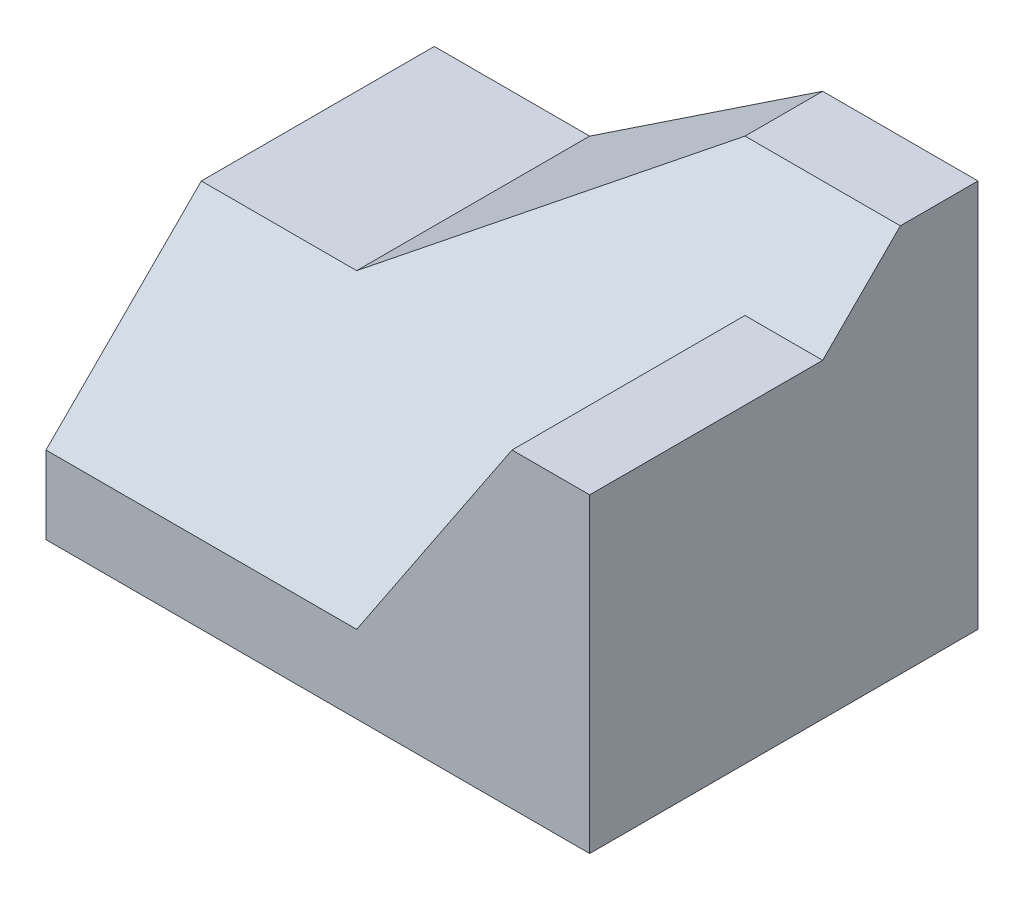
ISO-10303-21;
HEADER;
FILE_DESCRIPTION(('STEP AP214'),'2;1');
FILE_NAME('part.step','',(''),(''),'','','');
FILE_SCHEMA(('AUTOMOTIVE_DESIGN { 1 0 10303 214 1 1 1 1 }'));
ENDSEC;
DATA;
#1=APPLICATION_CONTEXT('core data for automotive mechanical design processes');
#2=APPLICATION_PROTOCOL_DEFINITION('international standard','automotive_design',2000,#1);
#3=PRODUCT_CONTEXT('',#1,'mechanical');
#4=PRODUCT('Part','Part','',(#3));
#5=PRODUCT_RELATED_PRODUCT_CATEGORY('part','',(#4));
#6=PRODUCT_DEFINITION_FORMATION('','',#4);
#7=PRODUCT_DEFINITION_CONTEXT('part definition',#1,'design');
#8=PRODUCT_DEFINITION('design','',#6,#7);
#9=PRODUCT_DEFINITION_SHAPE('','',#8);
#10=(LENGTH_UNIT() NAMED_UNIT(*) SI_UNIT(.MILLI.,.METRE.));
#11=(NAMED_UNIT(*) PLANE_ANGLE_UNIT() SI_UNIT($,.RADIAN.));
#12=(NAMED_UNIT(*) SI_UNIT($,.STERADIAN.) SOLID_ANGLE_UNIT());
#13=UNCERTAINTY_MEASURE_WITH_UNIT(LENGTH_MEASURE(1.E-05),#10,'distance_accuracy_value','');
#14=(GEOMETRIC_REPRESENTATION_CONTEXT(3) GLOBAL_UNCERTAINTY_ASSIGNED_CONTEXT((#13)) GLOBAL_UNIT_ASSIGNED_CONTEXT((#10,
#11,#12)) REPRESENTATION_CONTEXT('',''));
#15=CARTESIAN_POINT('',(0.,0.,0.));
#16=DIRECTION('',(0.,0.,1.));
#17=DIRECTION('',(1.,0.,0.));
#18=AXIS2_PLACEMENT_3D('',#15,#16,#17);
#19=CARTESIAN_POINT('',(0.,0.,50.));
#20=DIRECTION('',(1.,0.,0.));
#21=DIRECTION('',(0.,0.,-1.));
#22=AXIS2_PLACEMENT_3D('',#19,#20,#21);
#23=PLANE('',#22);
#24=DIRECTION('',(0.,-1.,0.));
#25=VECTOR('',#24,1.);
#26=CARTESIAN_POINT('',(0.,0.,0.));
#27=LINE('',#26,#25);
#28=CARTESIAN_POINT('',(0.,30.,0.));
#29=VERTEX_POINT('',#28);
#30=CARTESIAN_POINT('',(0.,0.,0.));
#31=VERTEX_POINT('',#30);
#32=EDGE_CURVE('E149',#29,#31,#27,.T.);
#33=ORIENTED_EDGE('',*,*,#32,.T.);
#34=DIRECTION('',(0.,0.,-1.));
#35=VECTOR('',#34,1.);
#36=CARTESIAN_POINT('',(0.,0.,50.));
#37=LINE('',#36,#35);
#38=CARTESIAN_POINT('',(0.,0.,50.));
#39=VERTEX_POINT('',#38);
#40=EDGE_CURVE('E11',#39,#31,#37,.T.);
#41=ORIENTED_EDGE('',*,*,#40,.F.);
#42=DIRECTION('',(0.,-1.,0.));
#43=VECTOR('',#42,1.);
#44=CARTESIAN_POINT('',(0.,0.,50.));
#45=LINE('',#44,#43);
#46=CARTESIAN_POINT('',(0.,10.,50.));
#47=VERTEX_POINT('',#46);
#48=EDGE_CURVE('E152',#47,#39,#45,.T.);
#49=ORIENTED_EDGE('',*,*,#48,.F.);
#50=DIRECTION('',(0.,0.707106781186548,-0.707106781186548));
#51=VECTOR('',#50,1.);
#52=CARTESIAN_POINT('',(0.,10.,50.));
#53=LINE('',#52,#51);
#54=CARTESIAN_POINT('',(0.,30.,30.));
#55=VERTEX_POINT('',#54);
#56=EDGE_CURVE('E117',#47,#55,#53,.T.);
#57=ORIENTED_EDGE('',*,*,#56,.T.);
#58=DIRECTION('',(0.,0.,1.));
#59=VECTOR('',#58,1.);
#60=CARTESIAN_POINT('',(0.,30.,0.));
#61=LINE('',#60,#59);
#62=EDGE_CURVE('E110',#29,#55,#61,.T.);
#63=ORIENTED_EDGE('',*,*,#62,.F.);
#64=EDGE_LOOP('',(#33,#41,#49,#57,#63));
#65=FACE_BOUND('',#64,.T.);
#66=ADVANCED_FACE('F35',(#65),#23,.F.);
#67=CARTESIAN_POINT('',(20.,30.,0.));
#68=DIRECTION('',(0.554700196225231,-0.832050294337842,0.));
#69=DIRECTION('',(0.832050294337842,0.554700196225231,0.));
#70=AXIS2_PLACEMENT_3D('',#67,#68,#69);
#71=PLANE('',#70);
#72=DIRECTION('',(0.,0.,1.));
#73=VECTOR('',#72,1.);
#74=CARTESIAN_POINT('',(20.,30.,0.));
#75=LINE('',#74,#73);
#76=CARTESIAN_POINT('',(20.,30.,0.));
#77=VERTEX_POINT('',#76);
#78=CARTESIAN_POINT('',(20.,30.,30.));
#79=VERTEX_POINT('',#78);
#80=EDGE_CURVE('E101',#77,#79,#75,.T.);
#81=ORIENTED_EDGE('',*,*,#80,.T.);
#82=DIRECTION('',(-0.727606875108997,-0.485071250072668,0.485071250072668));
#83=VECTOR('',#82,1.);
#84=CARTESIAN_POINT('',(27.0588235294118,34.7058823529412,25.2941176470588));
#85=LINE('',#84,#83);
#86=CARTESIAN_POINT('',(49.9999999999998,50.,10.));
#87=VERTEX_POINT('',#86);
#88=EDGE_CURVE('E105',#87,#79,#85,.T.);
#89=ORIENTED_EDGE('',*,*,#88,.F.);
#90=DIRECTION('',(0.,0.,1.));
#91=VECTOR('',#90,1.);
#92=CARTESIAN_POINT('',(49.9999999999998,50.,0.));
#93=LINE('',#92,#91);
#94=CARTESIAN_POINT('',(49.9999999999998,50.,0.));
#95=VERTEX_POINT('',#94);
#96=EDGE_CURVE('E109',#95,#87,#93,.T.);
#97=ORIENTED_EDGE('',*,*,#96,.F.);
#98=DIRECTION('',(0.832050294337842,0.554700196225231,0.));
#99=VECTOR('',#98,1.);
#100=CARTESIAN_POINT('',(20.,30.,0.));
#101=LINE('',#100,#99);
#102=EDGE_CURVE('E57',#77,#95,#101,.T.);
#103=ORIENTED_EDGE('',*,*,#102,.F.);
#104=EDGE_LOOP('',(#81,#89,#97,#103));
#105=FACE_BOUND('',#104,.T.);
#106=ADVANCED_FACE('F103',(#105),#71,.F.);
#107=CARTESIAN_POINT('',(0.,30.,0.));
#108=DIRECTION('',(0.,-1.,0.));
#109=DIRECTION('',(0.,0.,-1.));
#110=AXIS2_PLACEMENT_3D('',#107,#108,#109);
#111=PLANE('',#110);
#112=ORIENTED_EDGE('',*,*,#62,.T.);
#113=DIRECTION('',(-1.,0.,0.));
#114=VECTOR('',#113,1.);
#115=CARTESIAN_POINT('',(20.,30.,30.));
#116=LINE('',#115,#114);
#117=EDGE_CURVE('E113',#79,#55,#116,.T.);
#118=ORIENTED_EDGE('',*,*,#117,.F.);
#119=ORIENTED_EDGE('',*,*,#80,.F.);
#120=DIRECTION('',(1.,0.,0.));
#121=VECTOR('',#120,1.);
#122=CARTESIAN_POINT('',(0.,30.,0.));
#123=LINE('',#122,#121);
#124=EDGE_CURVE('E143',#29,#77,#123,.T.);
#125=ORIENTED_EDGE('',*,*,#124,.F.);
#126=EDGE_LOOP('',(#112,#118,#119,#125));
#127=FACE_BOUND('',#126,.T.);
#128=ADVANCED_FACE('F114',(#127),#111,.F.);
#129=CARTESIAN_POINT('',(0.,0.,50.));
#130=DIRECTION('',(0.,1.,0.));
#131=DIRECTION('',(0.,0.,1.));
#132=AXIS2_PLACEMENT_3D('',#129,#130,#131);
#133=PLANE('',#132);
#134=ORIENTED_EDGE('',*,*,#40,.T.);
#135=DIRECTION('',(1.,0.,0.));
#136=VECTOR('',#135,1.);
#137=CARTESIAN_POINT('',(0.,0.,0.));
#138=LINE('',#137,#136);
#139=CARTESIAN_POINT('',(70.,0.,0.));
#140=VERTEX_POINT('',#139);
#141=EDGE_CURVE('E163',#31,#140,#138,.T.);
#142=ORIENTED_EDGE('',*,*,#141,.T.);
#143=DIRECTION('',(0.,0.,-1.));
#144=VECTOR('',#143,1.);
#145=CARTESIAN_POINT('',(70.,0.,50.));
#146=LINE('',#145,#144);
#147=CARTESIAN_POINT('',(70.,0.,50.));
#148=VERTEX_POINT('',#147);
#149=EDGE_CURVE('E42',#148,#140,#146,.T.);
#150=ORIENTED_EDGE('',*,*,#149,.F.);
#151=DIRECTION('',(1.,0.,0.));
#152=VECTOR('',#151,1.);
#153=CARTESIAN_POINT('',(0.,0.,50.));
#154=LINE('',#153,#152);
#155=EDGE_CURVE('E154',#39,#148,#154,.T.);
#156=ORIENTED_EDGE('',*,*,#155,.F.);
#157=EDGE_LOOP('',(#134,#142,#150,#156));
#158=FACE_BOUND('',#157,.T.);
#159=ADVANCED_FACE('F196',(#158),#133,.F.);
#160=CARTESIAN_POINT('',(0.,0.,0.));
#161=DIRECTION('',(0.,0.,-1.));
#162=DIRECTION('',(-1.,0.,0.));
#163=AXIS2_PLACEMENT_3D('',#160,#161,#162);
#164=PLANE('',#163);
#165=DIRECTION('',(-1.,0.,0.));
#166=VECTOR('',#165,1.);
#167=CARTESIAN_POINT('',(0.,50.,0.));
#168=LINE('',#167,#166);
#169=CARTESIAN_POINT('',(70.,50.,0.));
#170=VERTEX_POINT('',#169);
#171=EDGE_CURVE('E155',#170,#95,#168,.T.);
#172=ORIENTED_EDGE('',*,*,#171,.F.);
#173=DIRECTION('',(0.,1.,0.));
#174=VECTOR('',#173,1.);
#175=CARTESIAN_POINT('',(70.,0.,0.));
#176=LINE('',#175,#174);
#177=EDGE_CURVE('E165',#140,#170,#176,.T.);
#178=ORIENTED_EDGE('',*,*,#177,.F.);
#179=ORIENTED_EDGE('',*,*,#141,.F.);
#180=ORIENTED_EDGE('',*,*,#32,.F.);
#181=ORIENTED_EDGE('',*,*,#124,.T.);
#182=ORIENTED_EDGE('',*,*,#102,.T.);
#183=EDGE_LOOP('',(#172,#178,#179,#180,#181,#182));
#184=FACE_BOUND('',#183,.T.);
#185=ADVANCED_FACE('F183',(#184),#164,.T.);
#186=CARTESIAN_POINT('',(0.,0.,50.));
#187=DIRECTION('',(0.,0.,-1.));
#188=DIRECTION('',(-1.,0.,0.));
#189=AXIS2_PLACEMENT_3D('',#186,#187,#188);
#190=PLANE('',#189);
#191=DIRECTION('',(-1.,0.,0.));
#192=VECTOR('',#191,1.);
#193=CARTESIAN_POINT('',(0.,10.,50.));
#194=LINE('',#193,#192);
#195=CARTESIAN_POINT('',(40.,10.,50.));
#196=VERTEX_POINT('',#195);
#197=EDGE_CURVE('E127',#196,#47,#194,.T.);
#198=ORIENTED_EDGE('',*,*,#197,.T.);
#199=ORIENTED_EDGE('',*,*,#48,.T.);
#200=ORIENTED_EDGE('',*,*,#155,.T.);
#201=DIRECTION('',(0.,1.,0.));
#202=VECTOR('',#201,1.);
#203=CARTESIAN_POINT('',(70.,0.,50.));
#204=LINE('',#203,#202);
#205=CARTESIAN_POINT('',(70.,40.,50.));
#206=VERTEX_POINT('',#205);
#207=EDGE_CURVE('E157',#148,#206,#204,.T.);
#208=ORIENTED_EDGE('',*,*,#207,.T.);
#209=DIRECTION('',(1.,0.,0.));
#210=VECTOR('',#209,1.);
#211=CARTESIAN_POINT('',(20.,40.,50.));
#212=LINE('',#211,#210);
#213=CARTESIAN_POINT('',(60.,40.,50.));
#214=VERTEX_POINT('',#213);
#215=EDGE_CURVE('E141',#214,#206,#212,.T.);
#216=ORIENTED_EDGE('',*,*,#215,.F.);
#217=DIRECTION('',(-0.554700196225229,-0.832050294337844,0.));
#218=VECTOR('',#217,1.);
#219=CARTESIAN_POINT('',(23.0769230769231,-15.3846153846154,50.));
#220=LINE('',#219,#218);
#221=EDGE_CURVE('E130',#214,#196,#220,.T.);
#222=ORIENTED_EDGE('',*,*,#221,.T.);
#223=EDGE_LOOP('',(#198,#199,#200,#208,#216,#222));
#224=FACE_BOUND('',#223,.T.);
#225=ADVANCED_FACE('F193',(#224),#190,.F.);
#226=CARTESIAN_POINT('',(20.,40.,50.));
#227=DIRECTION('',(0.,-1.,0.));
#228=DIRECTION('',(0.,0.,-1.));
#229=AXIS2_PLACEMENT_3D('',#226,#227,#228);
#230=PLANE('',#229);
#231=DIRECTION('',(0.,0.,1.));
#232=VECTOR('',#231,1.);
#233=CARTESIAN_POINT('',(60.,40.,20.));
#234=LINE('',#233,#232);
#235=CARTESIAN_POINT('',(60.,40.,20.));
#236=VERTEX_POINT('',#235);
#237=EDGE_CURVE('E133',#236,#214,#234,.T.);
#238=ORIENTED_EDGE('',*,*,#237,.T.);
#239=ORIENTED_EDGE('',*,*,#215,.T.);
#240=DIRECTION('',(0.,0.,-1.));
#241=VECTOR('',#240,1.);
#242=CARTESIAN_POINT('',(70.,40.,50.));
#243=LINE('',#242,#241);
#244=CARTESIAN_POINT('',(70.,40.,20.));
#245=VERTEX_POINT('',#244);
#246=EDGE_CURVE('E136',#206,#245,#243,.T.);
#247=ORIENTED_EDGE('',*,*,#246,.T.);
#248=DIRECTION('',(1.,0.,0.));
#249=VECTOR('',#248,1.);
#250=CARTESIAN_POINT('',(20.,40.,20.));
#251=LINE('',#250,#249);
#252=EDGE_CURVE('E144',#236,#245,#251,.T.);
#253=ORIENTED_EDGE('',*,*,#252,.F.);
#254=EDGE_LOOP('',(#238,#239,#247,#253));
#255=FACE_BOUND('',#254,.T.);
#256=ADVANCED_FACE('F190',(#255),#230,.F.);
#257=CARTESIAN_POINT('',(70.,0.,50.));
#258=DIRECTION('',(-1.,0.,0.));
#259=DIRECTION('',(0.,0.,1.));
#260=AXIS2_PLACEMENT_3D('',#257,#258,#259);
#261=PLANE('',#260);
#262=DIRECTION('',(0.,0.,-1.));
#263=VECTOR('',#262,1.);
#264=CARTESIAN_POINT('',(70.,50.,50.));
#265=LINE('',#264,#263);
#266=CARTESIAN_POINT('',(70.,50.,10.));
#267=VERTEX_POINT('',#266);
#268=EDGE_CURVE('E160',#267,#170,#265,.T.);
#269=ORIENTED_EDGE('',*,*,#268,.F.);
#270=DIRECTION('',(0.,0.707106781186548,-0.707106781186548));
#271=VECTOR('',#270,1.);
#272=CARTESIAN_POINT('',(70.,40.,20.));
#273=LINE('',#272,#271);
#274=EDGE_CURVE('E139',#245,#267,#273,.T.);
#275=ORIENTED_EDGE('',*,*,#274,.F.);
#276=ORIENTED_EDGE('',*,*,#246,.F.);
#277=ORIENTED_EDGE('',*,*,#207,.F.);
#278=ORIENTED_EDGE('',*,*,#149,.T.);
#279=ORIENTED_EDGE('',*,*,#177,.T.);
#280=EDGE_LOOP('',(#269,#275,#276,#277,#278,#279));
#281=FACE_BOUND('',#280,.T.);
#282=ADVANCED_FACE('F176',(#281),#261,.F.);
#283=CARTESIAN_POINT('',(0.,50.,50.));
#284=DIRECTION('',(0.,-1.,0.));
#285=DIRECTION('',(0.,0.,-1.));
#286=AXIS2_PLACEMENT_3D('',#283,#284,#285);
#287=PLANE('',#286);
#288=ORIENTED_EDGE('',*,*,#96,.T.);
#289=DIRECTION('',(1.,0.,0.));
#290=VECTOR('',#289,1.);
#291=CARTESIAN_POINT('',(20.,50.,10.));
#292=LINE('',#291,#290);
#293=EDGE_CURVE('E121',#87,#267,#292,.T.);
#294=ORIENTED_EDGE('',*,*,#293,.T.);
#295=ORIENTED_EDGE('',*,*,#268,.T.);
#296=ORIENTED_EDGE('',*,*,#171,.T.);
#297=EDGE_LOOP('',(#288,#294,#295,#296));
#298=FACE_BOUND('',#297,.T.);
#299=ADVANCED_FACE('F186',(#298),#287,.F.);
#300=CARTESIAN_POINT('',(20.,40.,20.));
#301=DIRECTION('',(0.,-0.707106781186548,-0.707106781186548));
#302=DIRECTION('',(0.,0.707106781186548,-0.707106781186548));
#303=AXIS2_PLACEMENT_3D('',#300,#301,#302);
#304=PLANE('',#303);
#305=ORIENTED_EDGE('',*,*,#88,.T.);
#306=ORIENTED_EDGE('',*,*,#117,.T.);
#307=ORIENTED_EDGE('',*,*,#56,.F.);
#308=ORIENTED_EDGE('',*,*,#197,.F.);
#309=DIRECTION('',(0.426401432711221,0.639602149066831,-0.639602149066831));
#310=VECTOR('',#309,1.);
#311=CARTESIAN_POINT('',(38.1818181818182,7.27272727272727,52.7272727272727));
#312=LINE('',#311,#310);
#313=EDGE_CURVE('E49',#196,#236,#312,.T.);
#314=ORIENTED_EDGE('',*,*,#313,.T.);
#315=ORIENTED_EDGE('',*,*,#252,.T.);
#316=ORIENTED_EDGE('',*,*,#274,.T.);
#317=ORIENTED_EDGE('',*,*,#293,.F.);
#318=EDGE_LOOP('',(#305,#306,#307,#308,#314,#315,#316,#317));
#319=FACE_BOUND('',#318,.T.);
#320=ADVANCED_FACE('F119',(#319),#304,.F.);
#321=CARTESIAN_POINT('',(23.0769230769231,-15.3846153846154,20.));
#322=DIRECTION('',(-0.832050294337844,0.554700196225229,0.));
#323=DIRECTION('',(-0.554700196225229,-0.832050294337844,0.));
#324=AXIS2_PLACEMENT_3D('',#321,#322,#323);
#325=PLANE('',#324);
#326=ORIENTED_EDGE('',*,*,#313,.F.);
#327=ORIENTED_EDGE('',*,*,#221,.F.);
#328=ORIENTED_EDGE('',*,*,#237,.F.);
#329=EDGE_LOOP('',(#326,#327,#328));
#330=FACE_BOUND('',#329,.T.);
#331=ADVANCED_FACE('F199',(#330),#325,.T.);
#332=CLOSED_SHELL('',(#66,#106,#128,#159,#185,#225,#256,#282,#299,#320,#331));
#333=MANIFOLD_SOLID_BREP('B2',#332);
#334=ADVANCED_BREP_SHAPE_REPRESENTATION('',(#18,#333),#14);
#335=SHAPE_DEFINITION_REPRESENTATION(#9,#334);
ENDSEC;
END-ISO-10303-21;
